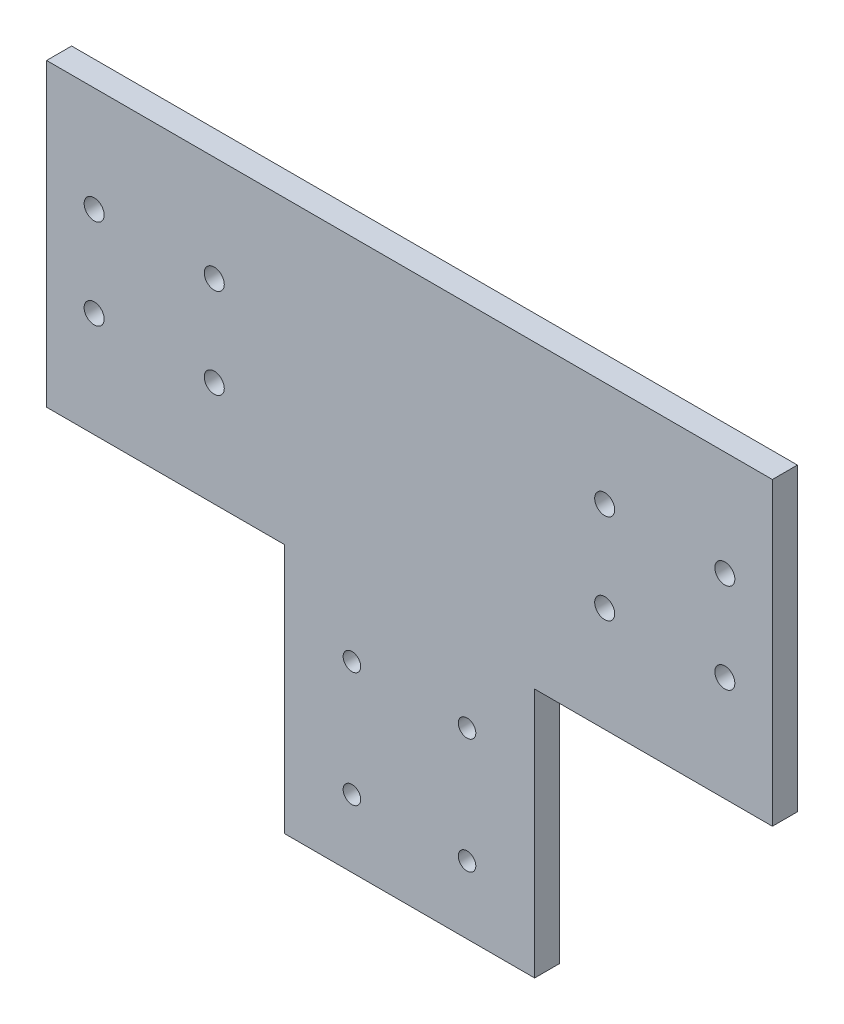
ISO-10303-21;
HEADER;
FILE_DESCRIPTION(('STEP AP214'),'2;1');
FILE_NAME('part.step','',(''),(''),'','','');
FILE_SCHEMA(('AUTOMOTIVE_DESIGN { 1 0 10303 214 1 1 1 1 }'));
ENDSEC;
DATA;
#1=APPLICATION_CONTEXT('core data for automotive mechanical design processes');
#2=APPLICATION_PROTOCOL_DEFINITION('international standard','automotive_design',2000,#1);
#3=PRODUCT_CONTEXT('',#1,'mechanical');
#4=PRODUCT('Part','Part','',(#3));
#5=PRODUCT_RELATED_PRODUCT_CATEGORY('part','',(#4));
#6=PRODUCT_DEFINITION_FORMATION('','',#4);
#7=PRODUCT_DEFINITION_CONTEXT('part definition',#1,'design');
#8=PRODUCT_DEFINITION('design','',#6,#7);
#9=PRODUCT_DEFINITION_SHAPE('','',#8);
#10=(LENGTH_UNIT() NAMED_UNIT(*) SI_UNIT(.MILLI.,.METRE.));
#11=(NAMED_UNIT(*) PLANE_ANGLE_UNIT() SI_UNIT($,.RADIAN.));
#12=(NAMED_UNIT(*) SI_UNIT($,.STERADIAN.) SOLID_ANGLE_UNIT());
#13=UNCERTAINTY_MEASURE_WITH_UNIT(LENGTH_MEASURE(1.E-05),#10,'distance_accuracy_value','');
#14=(GEOMETRIC_REPRESENTATION_CONTEXT(3) GLOBAL_UNCERTAINTY_ASSIGNED_CONTEXT((#13)) GLOBAL_UNIT_ASSIGNED_CONTEXT((#10,
#11,#12)) REPRESENTATION_CONTEXT('',''));
#15=CARTESIAN_POINT('',(0.,0.,0.));
#16=DIRECTION('',(0.,0.,1.));
#17=DIRECTION('',(1.,0.,0.));
#18=AXIS2_PLACEMENT_3D('',#15,#16,#17);
#19=CARTESIAN_POINT('',(0.,0.,5.));
#20=DIRECTION('',(0.,0.,-1.));
#21=DIRECTION('',(-1.,0.,0.));
#22=AXIS2_PLACEMENT_3D('',#19,#20,#21);
#23=PLANE('',#22);
#24=CARTESIAN_POINT('',(39.,9.00000000000003,5.));
#25=DIRECTION('',(0.,0.,1.));
#26=DIRECTION('',(-1.,0.,0.));
#27=AXIS2_PLACEMENT_3D('',#24,#25,#26);
#28=CIRCLE('',#27,2.);
#29=CARTESIAN_POINT('',(37.,9.00000000000003,5.));
#30=VERTEX_POINT('',#29);
#31=EDGE_CURVE('E237',#30,#30,#28,.T.);
#32=ORIENTED_EDGE('',*,*,#31,.F.);
#33=EDGE_LOOP('',(#32));
#34=FACE_BOUND('',#33,.T.);
#35=CARTESIAN_POINT('',(63.,-8.99999999999994,5.));
#36=DIRECTION('',(0.,0.,1.));
#37=DIRECTION('',(-1.,0.,0.));
#38=AXIS2_PLACEMENT_3D('',#35,#36,#37);
#39=CIRCLE('',#38,1.99999999999999);
#40=CARTESIAN_POINT('',(61.,-8.99999999999994,5.));
#41=VERTEX_POINT('',#40);
#42=EDGE_CURVE('E225',#41,#41,#39,.T.);
#43=ORIENTED_EDGE('',*,*,#42,.F.);
#44=EDGE_LOOP('',(#43));
#45=FACE_BOUND('',#44,.T.);
#46=CARTESIAN_POINT('',(-39.,-9.,5.));
#47=DIRECTION('',(0.,0.,1.));
#48=DIRECTION('',(1.,0.,0.));
#49=AXIS2_PLACEMENT_3D('',#46,#47,#48);
#50=CIRCLE('',#49,2.);
#51=CARTESIAN_POINT('',(-37.,-9.,5.));
#52=VERTEX_POINT('',#51);
#53=EDGE_CURVE('E213',#52,#52,#50,.T.);
#54=ORIENTED_EDGE('',*,*,#53,.F.);
#55=EDGE_LOOP('',(#54));
#56=FACE_BOUND('',#55,.T.);
#57=CARTESIAN_POINT('',(-63.,9.,5.));
#58=DIRECTION('',(0.,0.,1.));
#59=DIRECTION('',(1.,0.,0.));
#60=AXIS2_PLACEMENT_3D('',#57,#58,#59);
#61=CIRCLE('',#60,2.);
#62=CARTESIAN_POINT('',(-61.,9.,5.));
#63=VERTEX_POINT('',#62);
#64=EDGE_CURVE('E201',#63,#63,#61,.T.);
#65=ORIENTED_EDGE('',*,*,#64,.F.);
#66=EDGE_LOOP('',(#65));
#67=FACE_BOUND('',#66,.T.);
#68=CARTESIAN_POINT('',(11.5,-43.5,5.));
#69=DIRECTION('',(0.,0.,1.));
#70=DIRECTION('',(-1.,0.,0.));
#71=AXIS2_PLACEMENT_3D('',#68,#69,#70);
#72=CIRCLE('',#71,1.75);
#73=CARTESIAN_POINT('',(9.75000000000001,-43.5,5.));
#74=VERTEX_POINT('',#73);
#75=EDGE_CURVE('E189',#74,#74,#72,.T.);
#76=ORIENTED_EDGE('',*,*,#75,.F.);
#77=EDGE_LOOP('',(#76));
#78=FACE_BOUND('',#77,.T.);
#79=CARTESIAN_POINT('',(-11.5,-66.5,5.));
#80=DIRECTION('',(0.,0.,1.));
#81=DIRECTION('',(1.,0.,0.));
#82=AXIS2_PLACEMENT_3D('',#79,#80,#81);
#83=CIRCLE('',#82,1.75);
#84=CARTESIAN_POINT('',(-9.75,-66.5,5.));
#85=VERTEX_POINT('',#84);
#86=EDGE_CURVE('E135',#85,#85,#83,.T.);
#87=ORIENTED_EDGE('',*,*,#86,.F.);
#88=EDGE_LOOP('',(#87));
#89=FACE_BOUND('',#88,.T.);
#90=DIRECTION('',(1.,0.,0.));
#91=VECTOR('',#90,1.);
#92=CARTESIAN_POINT('',(25.,-30.,5.));
#93=LINE('',#92,#91);
#94=CARTESIAN_POINT('',(25.,-30.,5.));
#95=VERTEX_POINT('',#94);
#96=CARTESIAN_POINT('',(72.5,-30.,5.));
#97=VERTEX_POINT('',#96);
#98=EDGE_CURVE('E146',#95,#97,#93,.T.);
#99=ORIENTED_EDGE('',*,*,#98,.T.);
#100=DIRECTION('',(0.,1.,0.));
#101=VECTOR('',#100,1.);
#102=CARTESIAN_POINT('',(72.5,30.,5.));
#103=LINE('',#102,#101);
#104=CARTESIAN_POINT('',(72.5,30.,5.));
#105=VERTEX_POINT('',#104);
#106=EDGE_CURVE('E94',#97,#105,#103,.T.);
#107=ORIENTED_EDGE('',*,*,#106,.T.);
#108=DIRECTION('',(-1.,0.,0.));
#109=VECTOR('',#108,1.);
#110=CARTESIAN_POINT('',(-72.5,30.,5.));
#111=LINE('',#110,#109);
#112=CARTESIAN_POINT('',(-72.5,30.,5.));
#113=VERTEX_POINT('',#112);
#114=EDGE_CURVE('E161',#105,#113,#111,.T.);
#115=ORIENTED_EDGE('',*,*,#114,.T.);
#116=DIRECTION('',(0.,-1.,0.));
#117=VECTOR('',#116,1.);
#118=CARTESIAN_POINT('',(-72.5,30.,5.));
#119=LINE('',#118,#117);
#120=CARTESIAN_POINT('',(-72.5,-30.,5.));
#121=VERTEX_POINT('',#120);
#122=EDGE_CURVE('E174',#113,#121,#119,.T.);
#123=ORIENTED_EDGE('',*,*,#122,.T.);
#124=DIRECTION('',(1.,0.,0.));
#125=VECTOR('',#124,1.);
#126=CARTESIAN_POINT('',(-72.5,-30.,5.));
#127=LINE('',#126,#125);
#128=CARTESIAN_POINT('',(-25.,-30.,5.));
#129=VERTEX_POINT('',#128);
#130=EDGE_CURVE('E113',#121,#129,#127,.T.);
#131=ORIENTED_EDGE('',*,*,#130,.T.);
#132=DIRECTION('',(0.,-1.,0.));
#133=VECTOR('',#132,1.);
#134=CARTESIAN_POINT('',(-25.,-30.,5.));
#135=LINE('',#134,#133);
#136=CARTESIAN_POINT('',(-25.,-80.,5.));
#137=VERTEX_POINT('',#136);
#138=EDGE_CURVE('E107',#129,#137,#135,.T.);
#139=ORIENTED_EDGE('',*,*,#138,.T.);
#140=DIRECTION('',(1.,0.,0.));
#141=VECTOR('',#140,1.);
#142=CARTESIAN_POINT('',(-25.,-80.,5.));
#143=LINE('',#142,#141);
#144=CARTESIAN_POINT('',(25.,-80.,5.));
#145=VERTEX_POINT('',#144);
#146=EDGE_CURVE('E111',#137,#145,#143,.T.);
#147=ORIENTED_EDGE('',*,*,#146,.T.);
#148=DIRECTION('',(0.,1.,0.));
#149=VECTOR('',#148,1.);
#150=CARTESIAN_POINT('',(25.,-30.,5.));
#151=LINE('',#150,#149);
#152=EDGE_CURVE('E51',#145,#95,#151,.T.);
#153=ORIENTED_EDGE('',*,*,#152,.T.);
#154=EDGE_LOOP('',(#99,#107,#115,#123,#131,#139,#147,#153));
#155=FACE_BOUND('',#154,.T.);
#156=CARTESIAN_POINT('',(11.5,-66.5,5.));
#157=DIRECTION('',(0.,0.,1.));
#158=DIRECTION('',(1.,0.,0.));
#159=AXIS2_PLACEMENT_3D('',#156,#157,#158);
#160=CIRCLE('',#159,1.75);
#161=CARTESIAN_POINT('',(13.25,-66.5,5.));
#162=VERTEX_POINT('',#161);
#163=EDGE_CURVE('E183',#162,#162,#160,.T.);
#164=ORIENTED_EDGE('',*,*,#163,.F.);
#165=EDGE_LOOP('',(#164));
#166=FACE_BOUND('',#165,.T.);
#167=CARTESIAN_POINT('',(-11.5,-43.5,5.));
#168=DIRECTION('',(0.,0.,1.));
#169=DIRECTION('',(-1.,0.,0.));
#170=AXIS2_PLACEMENT_3D('',#167,#168,#169);
#171=CIRCLE('',#170,1.75);
#172=CARTESIAN_POINT('',(-13.25,-43.5,5.));
#173=VERTEX_POINT('',#172);
#174=EDGE_CURVE('E195',#173,#173,#171,.T.);
#175=ORIENTED_EDGE('',*,*,#174,.F.);
#176=EDGE_LOOP('',(#175));
#177=FACE_BOUND('',#176,.T.);
#178=CARTESIAN_POINT('',(-39.,9.,5.));
#179=DIRECTION('',(0.,0.,1.));
#180=DIRECTION('',(1.,0.,0.));
#181=AXIS2_PLACEMENT_3D('',#178,#179,#180);
#182=CIRCLE('',#181,2.);
#183=CARTESIAN_POINT('',(-37.,9.,5.));
#184=VERTEX_POINT('',#183);
#185=EDGE_CURVE('E207',#184,#184,#182,.T.);
#186=ORIENTED_EDGE('',*,*,#185,.F.);
#187=EDGE_LOOP('',(#186));
#188=FACE_BOUND('',#187,.T.);
#189=CARTESIAN_POINT('',(-63.,-9.,5.));
#190=DIRECTION('',(0.,0.,1.));
#191=DIRECTION('',(1.,0.,0.));
#192=AXIS2_PLACEMENT_3D('',#189,#190,#191);
#193=CIRCLE('',#192,2.);
#194=CARTESIAN_POINT('',(-61.,-9.,5.));
#195=VERTEX_POINT('',#194);
#196=EDGE_CURVE('E219',#195,#195,#193,.T.);
#197=ORIENTED_EDGE('',*,*,#196,.F.);
#198=EDGE_LOOP('',(#197));
#199=FACE_BOUND('',#198,.T.);
#200=CARTESIAN_POINT('',(39.,-8.99999999999996,5.));
#201=DIRECTION('',(0.,0.,1.));
#202=DIRECTION('',(-1.,0.,0.));
#203=AXIS2_PLACEMENT_3D('',#200,#201,#202);
#204=CIRCLE('',#203,2.);
#205=CARTESIAN_POINT('',(37.,-8.99999999999996,5.));
#206=VERTEX_POINT('',#205);
#207=EDGE_CURVE('E231',#206,#206,#204,.T.);
#208=ORIENTED_EDGE('',*,*,#207,.F.);
#209=EDGE_LOOP('',(#208));
#210=FACE_BOUND('',#209,.T.);
#211=CARTESIAN_POINT('',(63.,9.00000000000006,5.));
#212=DIRECTION('',(0.,0.,1.));
#213=DIRECTION('',(-1.,0.,0.));
#214=AXIS2_PLACEMENT_3D('',#211,#212,#213);
#215=CIRCLE('',#214,2.00000000000001);
#216=CARTESIAN_POINT('',(61.,9.00000000000006,5.));
#217=VERTEX_POINT('',#216);
#218=EDGE_CURVE('E243',#217,#217,#215,.T.);
#219=ORIENTED_EDGE('',*,*,#218,.F.);
#220=EDGE_LOOP('',(#219));
#221=FACE_BOUND('',#220,.T.);
#222=ADVANCED_FACE('F34',(#34,#45,#56,#67,#78,#89,#155,#166,#177,#188,#199,#210,#221),#23,.F.);
#223=CARTESIAN_POINT('',(0.,0.,0.));
#224=DIRECTION('',(0.,0.,-1.));
#225=DIRECTION('',(-1.,0.,0.));
#226=AXIS2_PLACEMENT_3D('',#223,#224,#225);
#227=PLANE('',#226);
#228=CARTESIAN_POINT('',(39.,9.00000000000003,0.));
#229=DIRECTION('',(0.,0.,1.));
#230=DIRECTION('',(-1.,0.,0.));
#231=AXIS2_PLACEMENT_3D('',#228,#229,#230);
#232=CIRCLE('',#231,2.);
#233=CARTESIAN_POINT('',(37.,9.00000000000003,0.));
#234=VERTEX_POINT('',#233);
#235=EDGE_CURVE('E240',#234,#234,#232,.T.);
#236=ORIENTED_EDGE('',*,*,#235,.T.);
#237=EDGE_LOOP('',(#236));
#238=FACE_BOUND('',#237,.T.);
#239=CARTESIAN_POINT('',(63.,-8.99999999999994,0.));
#240=DIRECTION('',(0.,0.,1.));
#241=DIRECTION('',(-1.,0.,0.));
#242=AXIS2_PLACEMENT_3D('',#239,#240,#241);
#243=CIRCLE('',#242,1.99999999999999);
#244=CARTESIAN_POINT('',(61.,-8.99999999999994,0.));
#245=VERTEX_POINT('',#244);
#246=EDGE_CURVE('E228',#245,#245,#243,.T.);
#247=ORIENTED_EDGE('',*,*,#246,.T.);
#248=EDGE_LOOP('',(#247));
#249=FACE_BOUND('',#248,.T.);
#250=CARTESIAN_POINT('',(-39.,-9.,0.));
#251=DIRECTION('',(0.,0.,1.));
#252=DIRECTION('',(1.,0.,0.));
#253=AXIS2_PLACEMENT_3D('',#250,#251,#252);
#254=CIRCLE('',#253,2.);
#255=CARTESIAN_POINT('',(-37.,-9.,0.));
#256=VERTEX_POINT('',#255);
#257=EDGE_CURVE('E216',#256,#256,#254,.T.);
#258=ORIENTED_EDGE('',*,*,#257,.T.);
#259=EDGE_LOOP('',(#258));
#260=FACE_BOUND('',#259,.T.);
#261=CARTESIAN_POINT('',(-63.,9.,0.));
#262=DIRECTION('',(0.,0.,1.));
#263=DIRECTION('',(1.,0.,0.));
#264=AXIS2_PLACEMENT_3D('',#261,#262,#263);
#265=CIRCLE('',#264,2.);
#266=CARTESIAN_POINT('',(-61.,9.,0.));
#267=VERTEX_POINT('',#266);
#268=EDGE_CURVE('E204',#267,#267,#265,.T.);
#269=ORIENTED_EDGE('',*,*,#268,.T.);
#270=EDGE_LOOP('',(#269));
#271=FACE_BOUND('',#270,.T.);
#272=CARTESIAN_POINT('',(11.5,-43.5,0.));
#273=DIRECTION('',(0.,0.,1.));
#274=DIRECTION('',(-1.,0.,0.));
#275=AXIS2_PLACEMENT_3D('',#272,#273,#274);
#276=CIRCLE('',#275,1.75);
#277=CARTESIAN_POINT('',(9.75000000000001,-43.5,0.));
#278=VERTEX_POINT('',#277);
#279=EDGE_CURVE('E192',#278,#278,#276,.T.);
#280=ORIENTED_EDGE('',*,*,#279,.T.);
#281=EDGE_LOOP('',(#280));
#282=FACE_BOUND('',#281,.T.);
#283=CARTESIAN_POINT('',(-11.5,-66.5,0.));
#284=DIRECTION('',(0.,0.,1.));
#285=DIRECTION('',(1.,0.,0.));
#286=AXIS2_PLACEMENT_3D('',#283,#284,#285);
#287=CIRCLE('',#286,1.75);
#288=CARTESIAN_POINT('',(-9.75,-66.5,0.));
#289=VERTEX_POINT('',#288);
#290=EDGE_CURVE('E180',#289,#289,#287,.T.);
#291=ORIENTED_EDGE('',*,*,#290,.T.);
#292=EDGE_LOOP('',(#291));
#293=FACE_BOUND('',#292,.T.);
#294=DIRECTION('',(1.,0.,0.));
#295=VECTOR('',#294,1.);
#296=CARTESIAN_POINT('',(25.,-30.,0.));
#297=LINE('',#296,#295);
#298=CARTESIAN_POINT('',(25.,-30.,0.));
#299=VERTEX_POINT('',#298);
#300=CARTESIAN_POINT('',(72.5,-30.,0.));
#301=VERTEX_POINT('',#300);
#302=EDGE_CURVE('E131',#299,#301,#297,.T.);
#303=ORIENTED_EDGE('',*,*,#302,.F.);
#304=DIRECTION('',(0.,1.,0.));
#305=VECTOR('',#304,1.);
#306=CARTESIAN_POINT('',(25.,-30.,0.));
#307=LINE('',#306,#305);
#308=CARTESIAN_POINT('',(25.,-80.,0.));
#309=VERTEX_POINT('',#308);
#310=EDGE_CURVE('E86',#309,#299,#307,.T.);
#311=ORIENTED_EDGE('',*,*,#310,.F.);
#312=DIRECTION('',(1.,0.,0.));
#313=VECTOR('',#312,1.);
#314=CARTESIAN_POINT('',(-25.,-80.,0.));
#315=LINE('',#314,#313);
#316=CARTESIAN_POINT('',(-25.,-80.,0.));
#317=VERTEX_POINT('',#316);
#318=EDGE_CURVE('E80',#317,#309,#315,.T.);
#319=ORIENTED_EDGE('',*,*,#318,.F.);
#320=DIRECTION('',(0.,-1.,0.));
#321=VECTOR('',#320,1.);
#322=CARTESIAN_POINT('',(-25.,-30.,0.));
#323=LINE('',#322,#321);
#324=CARTESIAN_POINT('',(-25.,-30.,0.));
#325=VERTEX_POINT('',#324);
#326=EDGE_CURVE('E121',#325,#317,#323,.T.);
#327=ORIENTED_EDGE('',*,*,#326,.F.);
#328=DIRECTION('',(1.,0.,0.));
#329=VECTOR('',#328,1.);
#330=CARTESIAN_POINT('',(-72.5,-30.,0.));
#331=LINE('',#330,#329);
#332=CARTESIAN_POINT('',(-72.5,-30.,0.));
#333=VERTEX_POINT('',#332);
#334=EDGE_CURVE('E141',#333,#325,#331,.T.);
#335=ORIENTED_EDGE('',*,*,#334,.F.);
#336=DIRECTION('',(0.,-1.,0.));
#337=VECTOR('',#336,1.);
#338=CARTESIAN_POINT('',(-72.5,30.,0.));
#339=LINE('',#338,#337);
#340=CARTESIAN_POINT('',(-72.5,30.,0.));
#341=VERTEX_POINT('',#340);
#342=EDGE_CURVE('E139',#341,#333,#339,.T.);
#343=ORIENTED_EDGE('',*,*,#342,.F.);
#344=DIRECTION('',(-1.,0.,0.));
#345=VECTOR('',#344,1.);
#346=CARTESIAN_POINT('',(-72.5,30.,0.));
#347=LINE('',#346,#345);
#348=CARTESIAN_POINT('',(72.5,30.,0.));
#349=VERTEX_POINT('',#348);
#350=EDGE_CURVE('E137',#349,#341,#347,.T.);
#351=ORIENTED_EDGE('',*,*,#350,.F.);
#352=DIRECTION('',(0.,1.,0.));
#353=VECTOR('',#352,1.);
#354=CARTESIAN_POINT('',(72.5,30.,0.));
#355=LINE('',#354,#353);
#356=EDGE_CURVE('E134',#301,#349,#355,.T.);
#357=ORIENTED_EDGE('',*,*,#356,.F.);
#358=EDGE_LOOP('',(#303,#311,#319,#327,#335,#343,#351,#357));
#359=FACE_BOUND('',#358,.T.);
#360=CARTESIAN_POINT('',(11.5,-66.5,0.));
#361=DIRECTION('',(0.,0.,1.));
#362=DIRECTION('',(1.,0.,0.));
#363=AXIS2_PLACEMENT_3D('',#360,#361,#362);
#364=CIRCLE('',#363,1.75);
#365=CARTESIAN_POINT('',(13.25,-66.5,0.));
#366=VERTEX_POINT('',#365);
#367=EDGE_CURVE('E186',#366,#366,#364,.T.);
#368=ORIENTED_EDGE('',*,*,#367,.T.);
#369=EDGE_LOOP('',(#368));
#370=FACE_BOUND('',#369,.T.);
#371=CARTESIAN_POINT('',(-11.5,-43.5,0.));
#372=DIRECTION('',(0.,0.,1.));
#373=DIRECTION('',(-1.,0.,0.));
#374=AXIS2_PLACEMENT_3D('',#371,#372,#373);
#375=CIRCLE('',#374,1.75);
#376=CARTESIAN_POINT('',(-13.25,-43.5,0.));
#377=VERTEX_POINT('',#376);
#378=EDGE_CURVE('E198',#377,#377,#375,.T.);
#379=ORIENTED_EDGE('',*,*,#378,.T.);
#380=EDGE_LOOP('',(#379));
#381=FACE_BOUND('',#380,.T.);
#382=CARTESIAN_POINT('',(-39.,9.,0.));
#383=DIRECTION('',(0.,0.,1.));
#384=DIRECTION('',(1.,0.,0.));
#385=AXIS2_PLACEMENT_3D('',#382,#383,#384);
#386=CIRCLE('',#385,2.);
#387=CARTESIAN_POINT('',(-37.,9.,0.));
#388=VERTEX_POINT('',#387);
#389=EDGE_CURVE('E210',#388,#388,#386,.T.);
#390=ORIENTED_EDGE('',*,*,#389,.T.);
#391=EDGE_LOOP('',(#390));
#392=FACE_BOUND('',#391,.T.);
#393=CARTESIAN_POINT('',(-63.,-9.,0.));
#394=DIRECTION('',(0.,0.,1.));
#395=DIRECTION('',(1.,0.,0.));
#396=AXIS2_PLACEMENT_3D('',#393,#394,#395);
#397=CIRCLE('',#396,2.);
#398=CARTESIAN_POINT('',(-61.,-9.,0.));
#399=VERTEX_POINT('',#398);
#400=EDGE_CURVE('E222',#399,#399,#397,.T.);
#401=ORIENTED_EDGE('',*,*,#400,.T.);
#402=EDGE_LOOP('',(#401));
#403=FACE_BOUND('',#402,.T.);
#404=CARTESIAN_POINT('',(39.,-8.99999999999996,0.));
#405=DIRECTION('',(0.,0.,1.));
#406=DIRECTION('',(-1.,0.,0.));
#407=AXIS2_PLACEMENT_3D('',#404,#405,#406);
#408=CIRCLE('',#407,2.);
#409=CARTESIAN_POINT('',(37.,-8.99999999999996,0.));
#410=VERTEX_POINT('',#409);
#411=EDGE_CURVE('E234',#410,#410,#408,.T.);
#412=ORIENTED_EDGE('',*,*,#411,.T.);
#413=EDGE_LOOP('',(#412));
#414=FACE_BOUND('',#413,.T.);
#415=CARTESIAN_POINT('',(63.,9.00000000000006,0.));
#416=DIRECTION('',(0.,0.,1.));
#417=DIRECTION('',(-1.,0.,0.));
#418=AXIS2_PLACEMENT_3D('',#415,#416,#417);
#419=CIRCLE('',#418,2.00000000000001);
#420=CARTESIAN_POINT('',(61.,9.00000000000006,0.));
#421=VERTEX_POINT('',#420);
#422=EDGE_CURVE('E246',#421,#421,#419,.T.);
#423=ORIENTED_EDGE('',*,*,#422,.T.);
#424=EDGE_LOOP('',(#423));
#425=FACE_BOUND('',#424,.T.);
#426=ADVANCED_FACE('F165',(#238,#249,#260,#271,#282,#293,#359,#370,#381,#392,#403,#414,#425),
#227,.T.);
#427=CARTESIAN_POINT('',(25.,-30.,5.));
#428=DIRECTION('',(0.,1.,0.));
#429=DIRECTION('',(-1.,0.,0.));
#430=AXIS2_PLACEMENT_3D('',#427,#428,#429);
#431=PLANE('',#430);
#432=ORIENTED_EDGE('',*,*,#302,.T.);
#433=DIRECTION('',(0.,0.,-1.));
#434=VECTOR('',#433,1.);
#435=CARTESIAN_POINT('',(72.5,-30.,5.));
#436=LINE('',#435,#434);
#437=EDGE_CURVE('E11',#97,#301,#436,.T.);
#438=ORIENTED_EDGE('',*,*,#437,.F.);
#439=ORIENTED_EDGE('',*,*,#98,.F.);
#440=DIRECTION('',(0.,0.,-1.));
#441=VECTOR('',#440,1.);
#442=CARTESIAN_POINT('',(25.,-30.,5.));
#443=LINE('',#442,#441);
#444=EDGE_CURVE('E127',#95,#299,#443,.T.);
#445=ORIENTED_EDGE('',*,*,#444,.T.);
#446=EDGE_LOOP('',(#432,#438,#439,#445));
#447=FACE_BOUND('',#446,.T.);
#448=ADVANCED_FACE('F36',(#447),#431,.F.);
#449=CARTESIAN_POINT('',(72.5,30.,5.));
#450=DIRECTION('',(-1.,0.,0.));
#451=DIRECTION('',(0.,-1.,0.));
#452=AXIS2_PLACEMENT_3D('',#449,#450,#451);
#453=PLANE('',#452);
#454=ORIENTED_EDGE('',*,*,#356,.T.);
#455=DIRECTION('',(0.,0.,-1.));
#456=VECTOR('',#455,1.);
#457=CARTESIAN_POINT('',(72.5,30.,5.));
#458=LINE('',#457,#456);
#459=EDGE_CURVE('E43',#105,#349,#458,.T.);
#460=ORIENTED_EDGE('',*,*,#459,.F.);
#461=ORIENTED_EDGE('',*,*,#106,.F.);
#462=ORIENTED_EDGE('',*,*,#437,.T.);
#463=EDGE_LOOP('',(#454,#460,#461,#462));
#464=FACE_BOUND('',#463,.T.);
#465=ADVANCED_FACE('F281',(#464),#453,.F.);
#466=CARTESIAN_POINT('',(-72.5,30.,5.));
#467=DIRECTION('',(0.,-1.,0.));
#468=DIRECTION('',(0.,0.,-1.));
#469=AXIS2_PLACEMENT_3D('',#466,#467,#468);
#470=PLANE('',#469);
#471=ORIENTED_EDGE('',*,*,#350,.T.);
#472=DIRECTION('',(0.,0.,-1.));
#473=VECTOR('',#472,1.);
#474=CARTESIAN_POINT('',(-72.5,30.,5.));
#475=LINE('',#474,#473);
#476=EDGE_CURVE('E153',#113,#341,#475,.T.);
#477=ORIENTED_EDGE('',*,*,#476,.F.);
#478=ORIENTED_EDGE('',*,*,#114,.F.);
#479=ORIENTED_EDGE('',*,*,#459,.T.);
#480=EDGE_LOOP('',(#471,#477,#478,#479));
#481=FACE_BOUND('',#480,.T.);
#482=ADVANCED_FACE('F159',(#481),#470,.F.);
#483=CARTESIAN_POINT('',(-72.5,30.,5.));
#484=DIRECTION('',(1.,0.,0.));
#485=DIRECTION('',(0.,0.,-1.));
#486=AXIS2_PLACEMENT_3D('',#483,#484,#485);
#487=PLANE('',#486);
#488=ORIENTED_EDGE('',*,*,#342,.T.);
#489=DIRECTION('',(0.,0.,-1.));
#490=VECTOR('',#489,1.);
#491=CARTESIAN_POINT('',(-72.5,-30.,5.));
#492=LINE('',#491,#490);
#493=EDGE_CURVE('E150',#121,#333,#492,.T.);
#494=ORIENTED_EDGE('',*,*,#493,.F.);
#495=ORIENTED_EDGE('',*,*,#122,.F.);
#496=ORIENTED_EDGE('',*,*,#476,.T.);
#497=EDGE_LOOP('',(#488,#494,#495,#496));
#498=FACE_BOUND('',#497,.T.);
#499=ADVANCED_FACE('F170',(#498),#487,.F.);
#500=CARTESIAN_POINT('',(-72.5,-30.,5.));
#501=DIRECTION('',(0.,1.,0.));
#502=DIRECTION('',(-1.,0.,0.));
#503=AXIS2_PLACEMENT_3D('',#500,#501,#502);
#504=PLANE('',#503);
#505=ORIENTED_EDGE('',*,*,#334,.T.);
#506=DIRECTION('',(0.,0.,-1.));
#507=VECTOR('',#506,1.);
#508=CARTESIAN_POINT('',(-25.,-30.,5.));
#509=LINE('',#508,#507);
#510=EDGE_CURVE('E122',#129,#325,#509,.T.);
#511=ORIENTED_EDGE('',*,*,#510,.F.);
#512=ORIENTED_EDGE('',*,*,#130,.F.);
#513=ORIENTED_EDGE('',*,*,#493,.T.);
#514=EDGE_LOOP('',(#505,#511,#512,#513));
#515=FACE_BOUND('',#514,.T.);
#516=ADVANCED_FACE('F173',(#515),#504,.F.);
#517=CARTESIAN_POINT('',(-25.,-30.,5.));
#518=DIRECTION('',(1.,0.,0.));
#519=DIRECTION('',(0.,1.,0.));
#520=AXIS2_PLACEMENT_3D('',#517,#518,#519);
#521=PLANE('',#520);
#522=ORIENTED_EDGE('',*,*,#326,.T.);
#523=DIRECTION('',(0.,0.,-1.));
#524=VECTOR('',#523,1.);
#525=CARTESIAN_POINT('',(-25.,-80.,5.));
#526=LINE('',#525,#524);
#527=EDGE_CURVE('E118',#137,#317,#526,.T.);
#528=ORIENTED_EDGE('',*,*,#527,.F.);
#529=ORIENTED_EDGE('',*,*,#138,.F.);
#530=ORIENTED_EDGE('',*,*,#510,.T.);
#531=EDGE_LOOP('',(#522,#528,#529,#530));
#532=FACE_BOUND('',#531,.T.);
#533=ADVANCED_FACE('F119',(#532),#521,.F.);
#534=CARTESIAN_POINT('',(-25.,-80.,5.));
#535=DIRECTION('',(0.,1.,0.));
#536=DIRECTION('',(0.,0.,1.));
#537=AXIS2_PLACEMENT_3D('',#534,#535,#536);
#538=PLANE('',#537);
#539=ORIENTED_EDGE('',*,*,#318,.T.);
#540=DIRECTION('',(0.,0.,-1.));
#541=VECTOR('',#540,1.);
#542=CARTESIAN_POINT('',(25.,-80.,5.));
#543=LINE('',#542,#541);
#544=EDGE_CURVE('E123',#145,#309,#543,.T.);
#545=ORIENTED_EDGE('',*,*,#544,.F.);
#546=ORIENTED_EDGE('',*,*,#146,.F.);
#547=ORIENTED_EDGE('',*,*,#527,.T.);
#548=EDGE_LOOP('',(#539,#545,#546,#547));
#549=FACE_BOUND('',#548,.T.);
#550=ADVANCED_FACE('F125',(#549),#538,.F.);
#551=CARTESIAN_POINT('',(25.,-30.,5.));
#552=DIRECTION('',(-1.,0.,0.));
#553=DIRECTION('',(0.,-1.,0.));
#554=AXIS2_PLACEMENT_3D('',#551,#552,#553);
#555=PLANE('',#554);
#556=ORIENTED_EDGE('',*,*,#310,.T.);
#557=ORIENTED_EDGE('',*,*,#444,.F.);
#558=ORIENTED_EDGE('',*,*,#152,.F.);
#559=ORIENTED_EDGE('',*,*,#544,.T.);
#560=EDGE_LOOP('',(#556,#557,#558,#559));
#561=FACE_BOUND('',#560,.T.);
#562=ADVANCED_FACE('F269',(#561),#555,.F.);
#563=CARTESIAN_POINT('',(-11.5,-66.5,5.));
#564=DIRECTION('',(0.,0.,-1.));
#565=DIRECTION('',(-1.,0.,0.));
#566=AXIS2_PLACEMENT_3D('',#563,#564,#565);
#567=CYLINDRICAL_SURFACE('',#566,1.75);
#568=ORIENTED_EDGE('',*,*,#86,.T.);
#569=EDGE_LOOP('',(#568));
#570=FACE_BOUND('',#569,.T.);
#571=ORIENTED_EDGE('',*,*,#290,.F.);
#572=EDGE_LOOP('',(#571));
#573=FACE_BOUND('',#572,.T.);
#574=ADVANCED_FACE('F266',(#570,#573),#567,.F.);
#575=CARTESIAN_POINT('',(11.5,-66.5,5.));
#576=DIRECTION('',(0.,0.,-1.));
#577=DIRECTION('',(-1.,0.,0.));
#578=AXIS2_PLACEMENT_3D('',#575,#576,#577);
#579=CYLINDRICAL_SURFACE('',#578,1.75);
#580=ORIENTED_EDGE('',*,*,#163,.T.);
#581=EDGE_LOOP('',(#580));
#582=FACE_BOUND('',#581,.T.);
#583=ORIENTED_EDGE('',*,*,#367,.F.);
#584=EDGE_LOOP('',(#583));
#585=FACE_BOUND('',#584,.T.);
#586=ADVANCED_FACE('F345',(#582,#585),#579,.F.);
#587=CARTESIAN_POINT('',(11.5,-43.5,5.));
#588=DIRECTION('',(0.,0.,-1.));
#589=DIRECTION('',(-1.,0.,0.));
#590=AXIS2_PLACEMENT_3D('',#587,#588,#589);
#591=CYLINDRICAL_SURFACE('',#590,1.75);
#592=ORIENTED_EDGE('',*,*,#75,.T.);
#593=EDGE_LOOP('',(#592));
#594=FACE_BOUND('',#593,.T.);
#595=ORIENTED_EDGE('',*,*,#279,.F.);
#596=EDGE_LOOP('',(#595));
#597=FACE_BOUND('',#596,.T.);
#598=ADVANCED_FACE('F353',(#594,#597),#591,.F.);
#599=CARTESIAN_POINT('',(-11.5,-43.5,5.));
#600=DIRECTION('',(0.,0.,-1.));
#601=DIRECTION('',(-1.,0.,0.));
#602=AXIS2_PLACEMENT_3D('',#599,#600,#601);
#603=CYLINDRICAL_SURFACE('',#602,1.75);
#604=ORIENTED_EDGE('',*,*,#174,.T.);
#605=EDGE_LOOP('',(#604));
#606=FACE_BOUND('',#605,.T.);
#607=ORIENTED_EDGE('',*,*,#378,.F.);
#608=EDGE_LOOP('',(#607));
#609=FACE_BOUND('',#608,.T.);
#610=ADVANCED_FACE('F361',(#606,#609),#603,.F.);
#611=CARTESIAN_POINT('',(-63.,9.,5.));
#612=DIRECTION('',(0.,0.,-1.));
#613=DIRECTION('',(-1.,0.,0.));
#614=AXIS2_PLACEMENT_3D('',#611,#612,#613);
#615=CYLINDRICAL_SURFACE('',#614,2.);
#616=ORIENTED_EDGE('',*,*,#64,.T.);
#617=EDGE_LOOP('',(#616));
#618=FACE_BOUND('',#617,.T.);
#619=ORIENTED_EDGE('',*,*,#268,.F.);
#620=EDGE_LOOP('',(#619));
#621=FACE_BOUND('',#620,.T.);
#622=ADVANCED_FACE('F370',(#618,#621),#615,.F.);
#623=CARTESIAN_POINT('',(-39.,9.,5.));
#624=DIRECTION('',(0.,0.,-1.));
#625=DIRECTION('',(-1.,0.,0.));
#626=AXIS2_PLACEMENT_3D('',#623,#624,#625);
#627=CYLINDRICAL_SURFACE('',#626,2.);
#628=ORIENTED_EDGE('',*,*,#185,.T.);
#629=EDGE_LOOP('',(#628));
#630=FACE_BOUND('',#629,.T.);
#631=ORIENTED_EDGE('',*,*,#389,.F.);
#632=EDGE_LOOP('',(#631));
#633=FACE_BOUND('',#632,.T.);
#634=ADVANCED_FACE('F379',(#630,#633),#627,.F.);
#635=CARTESIAN_POINT('',(-39.,-9.,5.));
#636=DIRECTION('',(0.,0.,-1.));
#637=DIRECTION('',(-1.,0.,0.));
#638=AXIS2_PLACEMENT_3D('',#635,#636,#637);
#639=CYLINDRICAL_SURFACE('',#638,2.);
#640=ORIENTED_EDGE('',*,*,#53,.T.);
#641=EDGE_LOOP('',(#640));
#642=FACE_BOUND('',#641,.T.);
#643=ORIENTED_EDGE('',*,*,#257,.F.);
#644=EDGE_LOOP('',(#643));
#645=FACE_BOUND('',#644,.T.);
#646=ADVANCED_FACE('F388',(#642,#645),#639,.F.);
#647=CARTESIAN_POINT('',(-63.,-9.,5.));
#648=DIRECTION('',(0.,0.,-1.));
#649=DIRECTION('',(-1.,0.,0.));
#650=AXIS2_PLACEMENT_3D('',#647,#648,#649);
#651=CYLINDRICAL_SURFACE('',#650,2.);
#652=ORIENTED_EDGE('',*,*,#196,.T.);
#653=EDGE_LOOP('',(#652));
#654=FACE_BOUND('',#653,.T.);
#655=ORIENTED_EDGE('',*,*,#400,.F.);
#656=EDGE_LOOP('',(#655));
#657=FACE_BOUND('',#656,.T.);
#658=ADVANCED_FACE('F397',(#654,#657),#651,.F.);
#659=CARTESIAN_POINT('',(63.,-8.99999999999994,5.));
#660=DIRECTION('',(0.,0.,-1.));
#661=DIRECTION('',(-1.,0.,0.));
#662=AXIS2_PLACEMENT_3D('',#659,#660,#661);
#663=CYLINDRICAL_SURFACE('',#662,1.99999999999999);
#664=ORIENTED_EDGE('',*,*,#42,.T.);
#665=EDGE_LOOP('',(#664));
#666=FACE_BOUND('',#665,.T.);
#667=ORIENTED_EDGE('',*,*,#246,.F.);
#668=EDGE_LOOP('',(#667));
#669=FACE_BOUND('',#668,.T.);
#670=ADVANCED_FACE('F406',(#666,#669),#663,.F.);
#671=CARTESIAN_POINT('',(39.,-8.99999999999996,5.));
#672=DIRECTION('',(0.,0.,-1.));
#673=DIRECTION('',(-1.,0.,0.));
#674=AXIS2_PLACEMENT_3D('',#671,#672,#673);
#675=CYLINDRICAL_SURFACE('',#674,2.);
#676=ORIENTED_EDGE('',*,*,#207,.T.);
#677=EDGE_LOOP('',(#676));
#678=FACE_BOUND('',#677,.T.);
#679=ORIENTED_EDGE('',*,*,#411,.F.);
#680=EDGE_LOOP('',(#679));
#681=FACE_BOUND('',#680,.T.);
#682=ADVANCED_FACE('F415',(#678,#681),#675,.F.);
#683=CARTESIAN_POINT('',(39.,9.00000000000003,5.));
#684=DIRECTION('',(0.,0.,-1.));
#685=DIRECTION('',(-1.,0.,0.));
#686=AXIS2_PLACEMENT_3D('',#683,#684,#685);
#687=CYLINDRICAL_SURFACE('',#686,2.);
#688=ORIENTED_EDGE('',*,*,#31,.T.);
#689=EDGE_LOOP('',(#688));
#690=FACE_BOUND('',#689,.T.);
#691=ORIENTED_EDGE('',*,*,#235,.F.);
#692=EDGE_LOOP('',(#691));
#693=FACE_BOUND('',#692,.T.);
#694=ADVANCED_FACE('F424',(#690,#693),#687,.F.);
#695=CARTESIAN_POINT('',(63.,9.00000000000006,5.));
#696=DIRECTION('',(0.,0.,-1.));
#697=DIRECTION('',(-1.,0.,0.));
#698=AXIS2_PLACEMENT_3D('',#695,#696,#697);
#699=CYLINDRICAL_SURFACE('',#698,2.00000000000001);
#700=ORIENTED_EDGE('',*,*,#218,.T.);
#701=EDGE_LOOP('',(#700));
#702=FACE_BOUND('',#701,.T.);
#703=ORIENTED_EDGE('',*,*,#422,.F.);
#704=EDGE_LOOP('',(#703));
#705=FACE_BOUND('',#704,.T.);
#706=ADVANCED_FACE('F252',(#702,#705),#699,.F.);
#707=CLOSED_SHELL('',(#222,#426,#448,#465,#482,#499,#516,#533,#550,#562,#574,#586,#598,#610,
#622,#634,#646,#658,#670,#682,#694,#706));
#708=MANIFOLD_SOLID_BREP('B2',#707);
#709=ADVANCED_BREP_SHAPE_REPRESENTATION('',(#18,#708),#14);
#710=SHAPE_DEFINITION_REPRESENTATION(#9,#709);
ENDSEC;
END-ISO-10303-21;
